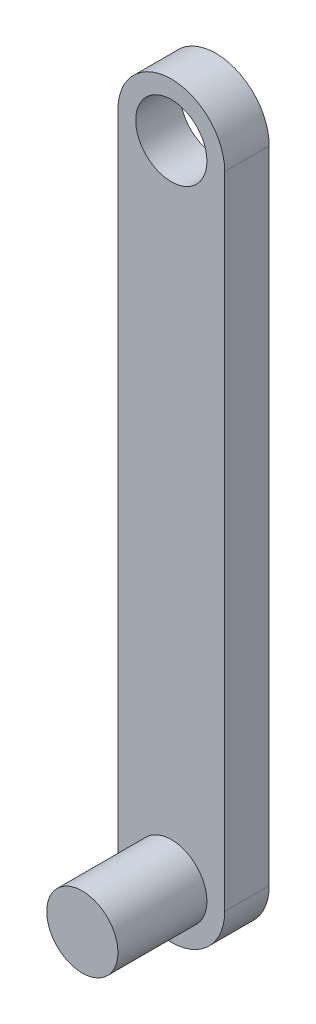
ISO-10303-21;
HEADER;
FILE_DESCRIPTION(('STEP AP214'),'2;1');
FILE_NAME('part.step','',(''),(''),'','','');
FILE_SCHEMA(('AUTOMOTIVE_DESIGN { 1 0 10303 214 1 1 1 1 }'));
ENDSEC;
DATA;
#1=APPLICATION_CONTEXT('core data for automotive mechanical design processes');
#2=APPLICATION_PROTOCOL_DEFINITION('international standard','automotive_design',2000,#1);
#3=PRODUCT_CONTEXT('',#1,'mechanical');
#4=PRODUCT('Part','Part','',(#3));
#5=PRODUCT_RELATED_PRODUCT_CATEGORY('part','',(#4));
#6=PRODUCT_DEFINITION_FORMATION('','',#4);
#7=PRODUCT_DEFINITION_CONTEXT('part definition',#1,'design');
#8=PRODUCT_DEFINITION('design','',#6,#7);
#9=PRODUCT_DEFINITION_SHAPE('','',#8);
#10=(LENGTH_UNIT() NAMED_UNIT(*) SI_UNIT(.MILLI.,.METRE.));
#11=(NAMED_UNIT(*) PLANE_ANGLE_UNIT() SI_UNIT($,.RADIAN.));
#12=(NAMED_UNIT(*) SI_UNIT($,.STERADIAN.) SOLID_ANGLE_UNIT());
#13=UNCERTAINTY_MEASURE_WITH_UNIT(LENGTH_MEASURE(1.E-05),#10,'distance_accuracy_value','');
#14=(GEOMETRIC_REPRESENTATION_CONTEXT(3) GLOBAL_UNCERTAINTY_ASSIGNED_CONTEXT((#13)) GLOBAL_UNIT_ASSIGNED_CONTEXT((#10,
#11,#12)) REPRESENTATION_CONTEXT('',''));
#15=CARTESIAN_POINT('',(0.,0.,0.));
#16=DIRECTION('',(0.,0.,1.));
#17=DIRECTION('',(1.,0.,0.));
#18=AXIS2_PLACEMENT_3D('',#15,#16,#17);
#19=CARTESIAN_POINT('',(0.,-36.,5.));
#20=DIRECTION('',(0.,0.,1.));
#21=DIRECTION('',(1.,0.,0.));
#22=AXIS2_PLACEMENT_3D('',#19,#20,#21);
#23=PLANE('',#22);
#24=CARTESIAN_POINT('',(0.,-36.,5.));
#25=DIRECTION('',(0.,0.,1.));
#26=DIRECTION('',(1.,0.,0.));
#27=AXIS2_PLACEMENT_3D('',#24,#25,#26);
#28=CIRCLE('',#27,4.);
#29=CARTESIAN_POINT('',(4.,-36.,5.));
#30=VERTEX_POINT('',#29);
#31=EDGE_CURVE('E138',#30,#30,#28,.T.);
#32=ORIENTED_EDGE('',*,*,#31,.F.);
#33=EDGE_LOOP('',(#32));
#34=FACE_BOUND('',#33,.T.);
#35=CARTESIAN_POINT('',(0.,-36.,5.));
#36=DIRECTION('',(0.,0.,1.));
#37=DIRECTION('',(1.,0.,0.));
#38=AXIS2_PLACEMENT_3D('',#35,#36,#37);
#39=CIRCLE('',#38,6.);
#40=CARTESIAN_POINT('',(-6.,-36.,5.));
#41=VERTEX_POINT('',#40);
#42=CARTESIAN_POINT('',(6.,-36.,5.));
#43=VERTEX_POINT('',#42);
#44=EDGE_CURVE('E92',#41,#43,#39,.T.);
#45=ORIENTED_EDGE('',*,*,#44,.T.);
#46=DIRECTION('',(0.,1.,0.));
#47=VECTOR('',#46,1.);
#48=CARTESIAN_POINT('',(6.,-36.,5.));
#49=LINE('',#48,#47);
#50=CARTESIAN_POINT('',(5.99999999999999,36.,5.));
#51=VERTEX_POINT('',#50);
#52=EDGE_CURVE('E87',#43,#51,#49,.T.);
#53=ORIENTED_EDGE('',*,*,#52,.T.);
#54=CARTESIAN_POINT('',(0.,36.,5.));
#55=DIRECTION('',(0.,0.,1.));
#56=DIRECTION('',(1.,0.,0.));
#57=AXIS2_PLACEMENT_3D('',#54,#55,#56);
#58=CIRCLE('',#57,6.);
#59=CARTESIAN_POINT('',(-6.00000000000001,36.,5.));
#60=VERTEX_POINT('',#59);
#61=EDGE_CURVE('E90',#51,#60,#58,.T.);
#62=ORIENTED_EDGE('',*,*,#61,.T.);
#63=DIRECTION('',(0.,-1.,0.));
#64=VECTOR('',#63,1.);
#65=CARTESIAN_POINT('',(-6.,-36.,5.));
#66=LINE('',#65,#64);
#67=EDGE_CURVE('E57',#60,#41,#66,.T.);
#68=ORIENTED_EDGE('',*,*,#67,.T.);
#69=EDGE_LOOP('',(#45,#53,#62,#68));
#70=FACE_BOUND('',#69,.T.);
#71=CARTESIAN_POINT('',(0.,36.,5.));
#72=DIRECTION('',(0.,0.,1.));
#73=DIRECTION('',(1.,0.,0.));
#74=AXIS2_PLACEMENT_3D('',#71,#72,#73);
#75=CIRCLE('',#74,4.);
#76=CARTESIAN_POINT('',(3.99999999999999,36.,5.));
#77=VERTEX_POINT('',#76);
#78=EDGE_CURVE('E112',#77,#77,#75,.T.);
#79=ORIENTED_EDGE('',*,*,#78,.F.);
#80=EDGE_LOOP('',(#79));
#81=FACE_BOUND('',#80,.T.);
#82=ADVANCED_FACE('F39',(#34,#70,#81),#23,.T.);
#83=CARTESIAN_POINT('',(0.,-36.,0.));
#84=DIRECTION('',(0.,0.,1.));
#85=DIRECTION('',(1.,0.,0.));
#86=AXIS2_PLACEMENT_3D('',#83,#84,#85);
#87=PLANE('',#86);
#88=CARTESIAN_POINT('',(0.,-36.,0.));
#89=DIRECTION('',(0.,0.,1.));
#90=DIRECTION('',(1.,0.,0.));
#91=AXIS2_PLACEMENT_3D('',#88,#89,#90);
#92=CIRCLE('',#91,6.);
#93=CARTESIAN_POINT('',(-6.,-36.,0.));
#94=VERTEX_POINT('',#93);
#95=CARTESIAN_POINT('',(6.,-36.,0.));
#96=VERTEX_POINT('',#95);
#97=EDGE_CURVE('E108',#94,#96,#92,.T.);
#98=ORIENTED_EDGE('',*,*,#97,.F.);
#99=DIRECTION('',(0.,-1.,0.));
#100=VECTOR('',#99,1.);
#101=CARTESIAN_POINT('',(-6.,-36.,0.));
#102=LINE('',#101,#100);
#103=CARTESIAN_POINT('',(-6.00000000000001,36.,0.));
#104=VERTEX_POINT('',#103);
#105=EDGE_CURVE('E80',#104,#94,#102,.T.);
#106=ORIENTED_EDGE('',*,*,#105,.F.);
#107=CARTESIAN_POINT('',(0.,36.,0.));
#108=DIRECTION('',(0.,0.,1.));
#109=DIRECTION('',(1.,0.,0.));
#110=AXIS2_PLACEMENT_3D('',#107,#108,#109);
#111=CIRCLE('',#110,6.);
#112=CARTESIAN_POINT('',(5.99999999999999,36.,0.));
#113=VERTEX_POINT('',#112);
#114=EDGE_CURVE('E74',#113,#104,#111,.T.);
#115=ORIENTED_EDGE('',*,*,#114,.F.);
#116=DIRECTION('',(0.,1.,0.));
#117=VECTOR('',#116,1.);
#118=CARTESIAN_POINT('',(6.,-36.,0.));
#119=LINE('',#118,#117);
#120=EDGE_CURVE('E97',#96,#113,#119,.T.);
#121=ORIENTED_EDGE('',*,*,#120,.F.);
#122=EDGE_LOOP('',(#98,#106,#115,#121));
#123=FACE_BOUND('',#122,.T.);
#124=CARTESIAN_POINT('',(0.,36.,0.));
#125=DIRECTION('',(0.,0.,1.));
#126=DIRECTION('',(1.,0.,0.));
#127=AXIS2_PLACEMENT_3D('',#124,#125,#126);
#128=CIRCLE('',#127,4.);
#129=CARTESIAN_POINT('',(3.99999999999999,36.,0.));
#130=VERTEX_POINT('',#129);
#131=EDGE_CURVE('E130',#130,#130,#128,.T.);
#132=ORIENTED_EDGE('',*,*,#131,.T.);
#133=EDGE_LOOP('',(#132));
#134=FACE_BOUND('',#133,.T.);
#135=ADVANCED_FACE('F125',(#123,#134),#87,.F.);
#136=CARTESIAN_POINT('',(0.,-36.,5.));
#137=DIRECTION('',(0.,0.,-1.));
#138=DIRECTION('',(-1.,0.,0.));
#139=AXIS2_PLACEMENT_3D('',#136,#137,#138);
#140=CYLINDRICAL_SURFACE('',#139,6.);
#141=ORIENTED_EDGE('',*,*,#97,.T.);
#142=DIRECTION('',(0.,0.,-1.));
#143=VECTOR('',#142,1.);
#144=CARTESIAN_POINT('',(6.,-36.,5.));
#145=LINE('',#144,#143);
#146=EDGE_CURVE('E11',#43,#96,#145,.T.);
#147=ORIENTED_EDGE('',*,*,#146,.F.);
#148=ORIENTED_EDGE('',*,*,#44,.F.);
#149=DIRECTION('',(0.,0.,-1.));
#150=VECTOR('',#149,1.);
#151=CARTESIAN_POINT('',(-6.,-36.,5.));
#152=LINE('',#151,#150);
#153=EDGE_CURVE('E104',#41,#94,#152,.T.);
#154=ORIENTED_EDGE('',*,*,#153,.T.);
#155=EDGE_LOOP('',(#141,#147,#148,#154));
#156=FACE_BOUND('',#155,.T.);
#157=ADVANCED_FACE('F41',(#156),#140,.T.);
#158=CARTESIAN_POINT('',(6.,-36.,5.));
#159=DIRECTION('',(-1.,0.,0.));
#160=DIRECTION('',(0.,-1.,0.));
#161=AXIS2_PLACEMENT_3D('',#158,#159,#160);
#162=PLANE('',#161);
#163=ORIENTED_EDGE('',*,*,#120,.T.);
#164=DIRECTION('',(0.,0.,-1.));
#165=VECTOR('',#164,1.);
#166=CARTESIAN_POINT('',(5.99999999999999,36.,5.));
#167=LINE('',#166,#165);
#168=EDGE_CURVE('E49',#51,#113,#167,.T.);
#169=ORIENTED_EDGE('',*,*,#168,.F.);
#170=ORIENTED_EDGE('',*,*,#52,.F.);
#171=ORIENTED_EDGE('',*,*,#146,.T.);
#172=EDGE_LOOP('',(#163,#169,#170,#171));
#173=FACE_BOUND('',#172,.T.);
#174=ADVANCED_FACE('F96',(#173),#162,.F.);
#175=CARTESIAN_POINT('',(0.,36.,5.));
#176=DIRECTION('',(0.,0.,-1.));
#177=DIRECTION('',(-1.,0.,0.));
#178=AXIS2_PLACEMENT_3D('',#175,#176,#177);
#179=CYLINDRICAL_SURFACE('',#178,6.);
#180=ORIENTED_EDGE('',*,*,#114,.T.);
#181=DIRECTION('',(0.,0.,-1.));
#182=VECTOR('',#181,1.);
#183=CARTESIAN_POINT('',(-6.00000000000001,36.,5.));
#184=LINE('',#183,#182);
#185=EDGE_CURVE('E99',#60,#104,#184,.T.);
#186=ORIENTED_EDGE('',*,*,#185,.F.);
#187=ORIENTED_EDGE('',*,*,#61,.F.);
#188=ORIENTED_EDGE('',*,*,#168,.T.);
#189=EDGE_LOOP('',(#180,#186,#187,#188));
#190=FACE_BOUND('',#189,.T.);
#191=ADVANCED_FACE('F100',(#190),#179,.T.);
#192=CARTESIAN_POINT('',(-6.,-36.,5.));
#193=DIRECTION('',(1.,0.,0.));
#194=DIRECTION('',(0.,1.,0.));
#195=AXIS2_PLACEMENT_3D('',#192,#193,#194);
#196=PLANE('',#195);
#197=ORIENTED_EDGE('',*,*,#105,.T.);
#198=ORIENTED_EDGE('',*,*,#153,.F.);
#199=ORIENTED_EDGE('',*,*,#67,.F.);
#200=ORIENTED_EDGE('',*,*,#185,.T.);
#201=EDGE_LOOP('',(#197,#198,#199,#200));
#202=FACE_BOUND('',#201,.T.);
#203=ADVANCED_FACE('F122',(#202),#196,.F.);
#204=CARTESIAN_POINT('',(0.,36.,5.));
#205=DIRECTION('',(0.,0.,-1.));
#206=DIRECTION('',(-1.,0.,0.));
#207=AXIS2_PLACEMENT_3D('',#204,#205,#206);
#208=CYLINDRICAL_SURFACE('',#207,4.);
#209=ORIENTED_EDGE('',*,*,#78,.T.);
#210=EDGE_LOOP('',(#209));
#211=FACE_BOUND('',#210,.T.);
#212=ORIENTED_EDGE('',*,*,#131,.F.);
#213=EDGE_LOOP('',(#212));
#214=FACE_BOUND('',#213,.T.);
#215=ADVANCED_FACE('F151',(#211,#214),#208,.F.);
#216=CARTESIAN_POINT('',(0.,-36.,15.));
#217=DIRECTION('',(0.,0.,-1.));
#218=DIRECTION('',(-1.,0.,0.));
#219=AXIS2_PLACEMENT_3D('',#216,#217,#218);
#220=CYLINDRICAL_SURFACE('',#219,4.);
#221=CARTESIAN_POINT('',(0.,-36.,15.));
#222=DIRECTION('',(0.,0.,1.));
#223=DIRECTION('',(1.,0.,0.));
#224=AXIS2_PLACEMENT_3D('',#221,#222,#223);
#225=CIRCLE('',#224,4.);
#226=CARTESIAN_POINT('',(4.,-36.,15.));
#227=VERTEX_POINT('',#226);
#228=EDGE_CURVE('E134',#227,#227,#225,.T.);
#229=ORIENTED_EDGE('',*,*,#228,.F.);
#230=EDGE_LOOP('',(#229));
#231=FACE_BOUND('',#230,.T.);
#232=ORIENTED_EDGE('',*,*,#31,.T.);
#233=EDGE_LOOP('',(#232));
#234=FACE_BOUND('',#233,.T.);
#235=ADVANCED_FACE('F148',(#231,#234),#220,.T.);
#236=CARTESIAN_POINT('',(0.,-36.,15.));
#237=DIRECTION('',(0.,0.,1.));
#238=DIRECTION('',(1.,0.,0.));
#239=AXIS2_PLACEMENT_3D('',#236,#237,#238);
#240=PLANE('',#239);
#241=ORIENTED_EDGE('',*,*,#228,.T.);
#242=EDGE_LOOP('',(#241));
#243=FACE_BOUND('',#242,.T.);
#244=ADVANCED_FACE('F146',(#243),#240,.T.);
#245=CLOSED_SHELL('',(#82,#135,#157,#174,#191,#203,#215,#235,#244));
#246=MANIFOLD_SOLID_BREP('B2',#245);
#247=ADVANCED_BREP_SHAPE_REPRESENTATION('',(#18,#246),#14);
#248=SHAPE_DEFINITION_REPRESENTATION(#9,#247);
ENDSEC;
END-ISO-10303-21;
